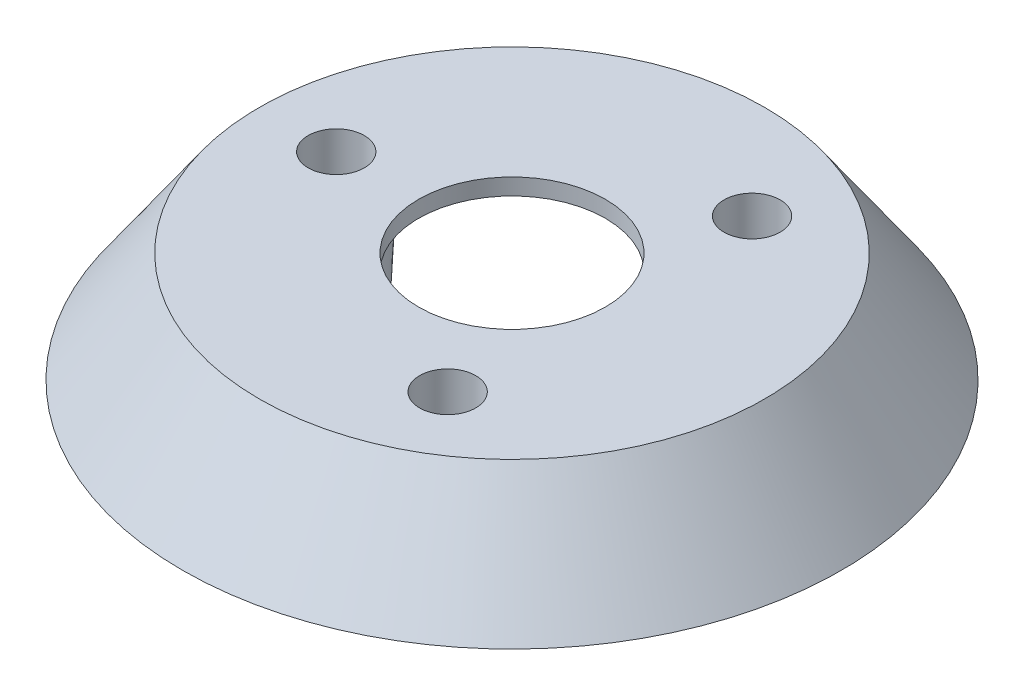
ISO-10303-21;
HEADER;
FILE_DESCRIPTION(('STEP AP214'),'2;1');
FILE_NAME('part.step','',(''),(''),'','','');
FILE_SCHEMA(('AUTOMOTIVE_DESIGN { 1 0 10303 214 1 1 1 1 }'));
ENDSEC;
DATA;
#1=APPLICATION_CONTEXT('core data for automotive mechanical design processes');
#2=APPLICATION_PROTOCOL_DEFINITION('international standard','automotive_design',2000,#1);
#3=PRODUCT_CONTEXT('',#1,'mechanical');
#4=PRODUCT('Part','Part','',(#3));
#5=PRODUCT_RELATED_PRODUCT_CATEGORY('part','',(#4));
#6=PRODUCT_DEFINITION_FORMATION('','',#4);
#7=PRODUCT_DEFINITION_CONTEXT('part definition',#1,'design');
#8=PRODUCT_DEFINITION('design','',#6,#7);
#9=PRODUCT_DEFINITION_SHAPE('','',#8);
#10=(LENGTH_UNIT() NAMED_UNIT(*) SI_UNIT(.MILLI.,.METRE.));
#11=(NAMED_UNIT(*) PLANE_ANGLE_UNIT() SI_UNIT($,.RADIAN.));
#12=(NAMED_UNIT(*) SI_UNIT($,.STERADIAN.) SOLID_ANGLE_UNIT());
#13=UNCERTAINTY_MEASURE_WITH_UNIT(LENGTH_MEASURE(1.E-05),#10,'distance_accuracy_value','');
#14=(GEOMETRIC_REPRESENTATION_CONTEXT(3) GLOBAL_UNCERTAINTY_ASSIGNED_CONTEXT((#13)) GLOBAL_UNIT_ASSIGNED_CONTEXT((#10,
#11,#12)) REPRESENTATION_CONTEXT('',''));
#15=CARTESIAN_POINT('',(0.,0.,0.));
#16=DIRECTION('',(0.,0.,1.));
#17=DIRECTION('',(1.,0.,0.));
#18=AXIS2_PLACEMENT_3D('',#15,#16,#17);
#19=CARTESIAN_POINT('',(0.,10.,0.));
#20=DIRECTION('',(0.,1.,0.));
#21=DIRECTION('',(0.,0.,1.));
#22=AXIS2_PLACEMENT_3D('',#19,#20,#21);
#23=PLANE('',#22);
#24=CARTESIAN_POINT('',(0.,10.,0.));
#25=DIRECTION('',(0.,1.,0.));
#26=DIRECTION('',(0.,0.,1.));
#27=AXIS2_PLACEMENT_3D('',#24,#25,#26);
#28=CIRCLE('',#27,8.5);
#29=CARTESIAN_POINT('',(0.,10.,8.5));
#30=VERTEX_POINT('',#29);
#31=EDGE_CURVE('E87',#30,#30,#28,.T.);
#32=ORIENTED_EDGE('',*,*,#31,.F.);
#33=EDGE_LOOP('',(#32));
#34=FACE_BOUND('',#33,.T.);
#35=CARTESIAN_POINT('',(7.99999999999987,10.,-13.8564064605511));
#36=DIRECTION('',(0.,1.,0.));
#37=DIRECTION('',(0.,0.,1.));
#38=AXIS2_PLACEMENT_3D('',#35,#36,#37);
#39=CIRCLE('',#38,2.55453387609415);
#40=CARTESIAN_POINT('',(7.99999999999987,10.,-16.4109403366452));
#41=VERTEX_POINT('',#40);
#42=EDGE_CURVE('E81',#41,#41,#39,.F.);
#43=ORIENTED_EDGE('',*,*,#42,.T.);
#44=EDGE_LOOP('',(#43));
#45=FACE_BOUND('',#44,.T.);
#46=CARTESIAN_POINT('',(8.00000000000007,10.,13.856406460551));
#47=DIRECTION('',(0.,1.,0.));
#48=DIRECTION('',(0.,0.,1.));
#49=AXIS2_PLACEMENT_3D('',#46,#47,#48);
#50=CIRCLE('',#49,2.55453387609415);
#51=CARTESIAN_POINT('',(8.00000000000007,10.,11.3018725844568));
#52=VERTEX_POINT('',#51);
#53=EDGE_CURVE('E75',#52,#52,#50,.F.);
#54=ORIENTED_EDGE('',*,*,#53,.T.);
#55=EDGE_LOOP('',(#54));
#56=FACE_BOUND('',#55,.T.);
#57=CARTESIAN_POINT('',(-16.,10.,0.));
#58=DIRECTION('',(0.,1.,0.));
#59=DIRECTION('',(0.,0.,1.));
#60=AXIS2_PLACEMENT_3D('',#57,#58,#59);
#61=CIRCLE('',#60,2.55453387609415);
#62=CARTESIAN_POINT('',(-16.,10.,-2.55453387609415));
#63=VERTEX_POINT('',#62);
#64=EDGE_CURVE('E67',#63,#63,#61,.F.);
#65=ORIENTED_EDGE('',*,*,#64,.T.);
#66=EDGE_LOOP('',(#65));
#67=FACE_BOUND('',#66,.T.);
#68=CARTESIAN_POINT('',(0.,10.,0.));
#69=DIRECTION('',(0.,1.,0.));
#70=DIRECTION('',(0.,0.,1.));
#71=AXIS2_PLACEMENT_3D('',#68,#69,#70);
#72=CIRCLE('',#71,22.9979246179029);
#73=CARTESIAN_POINT('',(0.,10.,22.9979246179029));
#74=VERTEX_POINT('',#73);
#75=EDGE_CURVE('E57',#74,#74,#72,.T.);
#76=ORIENTED_EDGE('',*,*,#75,.T.);
#77=EDGE_LOOP('',(#76));
#78=FACE_BOUND('',#77,.T.);
#79=ADVANCED_FACE('F31',(#34,#45,#56,#67,#78),#23,.T.);
#80=CARTESIAN_POINT('',(0.,0.,0.));
#81=DIRECTION('',(0.,1.,0.));
#82=DIRECTION('',(0.,0.,1.));
#83=AXIS2_PLACEMENT_3D('',#80,#81,#82);
#84=PLANE('',#83);
#85=CARTESIAN_POINT('',(0.,0.,0.));
#86=DIRECTION('',(0.,1.,0.));
#87=DIRECTION('',(0.,0.,1.));
#88=AXIS2_PLACEMENT_3D('',#85,#86,#87);
#89=CIRCLE('',#88,28.1688381168578);
#90=CARTESIAN_POINT('',(0.,0.,28.1688381168578));
#91=VERTEX_POINT('',#90);
#92=EDGE_CURVE('E64',#91,#91,#89,.T.);
#93=ORIENTED_EDGE('',*,*,#92,.T.);
#94=EDGE_LOOP('',(#93));
#95=FACE_BOUND('',#94,.T.);
#96=CARTESIAN_POINT('',(0.,0.,0.));
#97=DIRECTION('',(0.,1.,0.));
#98=DIRECTION('',(0.,0.,1.));
#99=AXIS2_PLACEMENT_3D('',#96,#97,#98);
#100=CIRCLE('',#99,30.);
#101=CARTESIAN_POINT('',(0.,0.,30.));
#102=VERTEX_POINT('',#101);
#103=EDGE_CURVE('E60',#102,#102,#100,.T.);
#104=ORIENTED_EDGE('',*,*,#103,.F.);
#105=EDGE_LOOP('',(#104));
#106=FACE_BOUND('',#105,.T.);
#107=ADVANCED_FACE('F123',(#95,#106),#84,.F.);
#108=CARTESIAN_POINT('',(0.,10.,0.));
#109=DIRECTION('',(0.,-1.,0.));
#110=DIRECTION('',(0.,0.,-1.));
#111=AXIS2_PLACEMENT_3D('',#108,#109,#110);
#112=CONICAL_SURFACE('',#111,22.9979246179029,0.610865238198013);
#113=ORIENTED_EDGE('',*,*,#103,.T.);
#114=EDGE_LOOP('',(#113));
#115=FACE_BOUND('',#114,.T.);
#116=ORIENTED_EDGE('',*,*,#75,.F.);
#117=EDGE_LOOP('',(#116));
#118=FACE_BOUND('',#117,.T.);
#119=ADVANCED_FACE('F100',(#115,#118),#112,.T.);
#120=CARTESIAN_POINT('',(0.,8.5,0.));
#121=DIRECTION('',(0.,1.,0.));
#122=DIRECTION('',(0.,0.,1.));
#123=AXIS2_PLACEMENT_3D('',#120,#121,#122);
#124=PLANE('',#123);
#125=CARTESIAN_POINT('',(0.,8.5,0.));
#126=DIRECTION('',(0.,-1.,0.));
#127=DIRECTION('',(0.,0.,-1.));
#128=AXIS2_PLACEMENT_3D('',#125,#126,#127);
#129=CIRCLE('',#128,8.5);
#130=CARTESIAN_POINT('',(0.,8.5,-8.5));
#131=VERTEX_POINT('',#130);
#132=EDGE_CURVE('E90',#131,#131,#129,.T.);
#133=ORIENTED_EDGE('',*,*,#132,.F.);
#134=EDGE_LOOP('',(#133));
#135=FACE_BOUND('',#134,.T.);
#136=CARTESIAN_POINT('',(7.99999999999987,8.5,-13.8564064605511));
#137=DIRECTION('',(0.,1.,0.));
#138=DIRECTION('',(0.,0.,1.));
#139=AXIS2_PLACEMENT_3D('',#136,#137,#138);
#140=CIRCLE('',#139,4.);
#141=CARTESIAN_POINT('',(7.99999999999987,8.5,-9.85640646055109));
#142=VERTEX_POINT('',#141);
#143=EDGE_CURVE('E42',#142,#142,#140,.F.);
#144=ORIENTED_EDGE('',*,*,#143,.F.);
#145=EDGE_LOOP('',(#144));
#146=FACE_BOUND('',#145,.T.);
#147=CARTESIAN_POINT('',(8.00000000000007,8.5,13.856406460551));
#148=DIRECTION('',(0.,1.,0.));
#149=DIRECTION('',(0.,0.,1.));
#150=AXIS2_PLACEMENT_3D('',#147,#148,#149);
#151=CIRCLE('',#150,4.);
#152=CARTESIAN_POINT('',(8.00000000000007,8.5,17.856406460551));
#153=VERTEX_POINT('',#152);
#154=EDGE_CURVE('E46',#153,#153,#151,.F.);
#155=ORIENTED_EDGE('',*,*,#154,.F.);
#156=EDGE_LOOP('',(#155));
#157=FACE_BOUND('',#156,.T.);
#158=CARTESIAN_POINT('',(-16.,8.5,0.));
#159=DIRECTION('',(0.,1.,0.));
#160=DIRECTION('',(0.,0.,1.));
#161=AXIS2_PLACEMENT_3D('',#158,#159,#160);
#162=CIRCLE('',#161,4.);
#163=CARTESIAN_POINT('',(-16.,8.5,4.));
#164=VERTEX_POINT('',#163);
#165=EDGE_CURVE('E54',#164,#164,#162,.F.);
#166=ORIENTED_EDGE('',*,*,#165,.F.);
#167=EDGE_LOOP('',(#166));
#168=FACE_BOUND('',#167,.T.);
#169=CARTESIAN_POINT('',(0.,8.5,0.));
#170=DIRECTION('',(0.,1.,0.));
#171=DIRECTION('',(0.,0.,1.));
#172=AXIS2_PLACEMENT_3D('',#169,#170,#171);
#173=CIRCLE('',#172,22.2170740420753);
#174=CARTESIAN_POINT('',(0.,8.5,22.2170740420753));
#175=VERTEX_POINT('',#174);
#176=EDGE_CURVE('E63',#175,#175,#173,.T.);
#177=ORIENTED_EDGE('',*,*,#176,.F.);
#178=EDGE_LOOP('',(#177));
#179=FACE_BOUND('',#178,.T.);
#180=ADVANCED_FACE('F96',(#135,#146,#157,#168,#179),#124,.F.);
#181=CARTESIAN_POINT('',(0.,9.13963534547343,0.));
#182=DIRECTION('',(0.,-1.,0.));
#183=DIRECTION('',(0.,0.,-1.));
#184=AXIS2_PLACEMENT_3D('',#181,#182,#183);
#185=CONICAL_SURFACE('',#184,21.7691965514694,0.610865238198013);
#186=ORIENTED_EDGE('',*,*,#92,.F.);
#187=EDGE_LOOP('',(#186));
#188=FACE_BOUND('',#187,.T.);
#189=ORIENTED_EDGE('',*,*,#176,.T.);
#190=EDGE_LOOP('',(#189));
#191=FACE_BOUND('',#190,.T.);
#192=ADVANCED_FACE('F99',(#188,#191),#185,.F.);
#193=CARTESIAN_POINT('',(-16.,0.,0.));
#194=DIRECTION('',(0.,-1.,0.));
#195=DIRECTION('',(0.,0.,-1.));
#196=AXIS2_PLACEMENT_3D('',#193,#194,#195);
#197=PLANE('',#196);
#198=CARTESIAN_POINT('',(-16.,0.,0.));
#199=DIRECTION('',(0.,-1.,0.));
#200=DIRECTION('',(0.,0.,-1.));
#201=AXIS2_PLACEMENT_3D('',#198,#199,#200);
#202=CIRCLE('',#201,2.55453387609415);
#203=CARTESIAN_POINT('',(-16.,0.,-2.55453387609415));
#204=VERTEX_POINT('',#203);
#205=EDGE_CURVE('E72',#204,#204,#202,.T.);
#206=ORIENTED_EDGE('',*,*,#205,.F.);
#207=EDGE_LOOP('',(#206));
#208=FACE_BOUND('',#207,.T.);
#209=CARTESIAN_POINT('',(-16.,0.,0.));
#210=DIRECTION('',(0.,-1.,0.));
#211=DIRECTION('',(0.,0.,-1.));
#212=AXIS2_PLACEMENT_3D('',#209,#210,#211);
#213=CIRCLE('',#212,3.55453387609415);
#214=CARTESIAN_POINT('',(-16.,0.,-3.55453387609415));
#215=VERTEX_POINT('',#214);
#216=EDGE_CURVE('E51',#215,#215,#213,.T.);
#217=ORIENTED_EDGE('',*,*,#216,.T.);
#218=EDGE_LOOP('',(#217));
#219=FACE_BOUND('',#218,.T.);
#220=ADVANCED_FACE('F111',(#208,#219),#197,.T.);
#221=CARTESIAN_POINT('',(-16.,0.,0.));
#222=DIRECTION('',(0.,1.,0.));
#223=DIRECTION('',(0.,0.,1.));
#224=AXIS2_PLACEMENT_3D('',#221,#222,#223);
#225=CONICAL_SURFACE('',#224,3.55453387609415,0.0523598775598264);
#226=ORIENTED_EDGE('',*,*,#165,.T.);
#227=EDGE_LOOP('',(#226));
#228=FACE_BOUND('',#227,.T.);
#229=ORIENTED_EDGE('',*,*,#216,.F.);
#230=EDGE_LOOP('',(#229));
#231=FACE_BOUND('',#230,.T.);
#232=ADVANCED_FACE('F117',(#228,#231),#225,.T.);
#233=CARTESIAN_POINT('',(-16.,17.2253129062277,0.));
#234=DIRECTION('',(0.,-1.,0.));
#235=DIRECTION('',(0.,0.,-1.));
#236=AXIS2_PLACEMENT_3D('',#233,#234,#235);
#237=CYLINDRICAL_SURFACE('',#236,2.55453387609415);
#238=CARTESIAN_POINT('',(-16.,0.,-2.55453387609415));
#239=CARTESIAN_POINT('',(-16.,0.104166666666667,-2.55453387609415));
#240=CARTESIAN_POINT('',(-16.,0.208333333333334,-2.55453387609415));
#241=CARTESIAN_POINT('',(-16.,0.416666666666667,-2.55453387609415));
#242=CARTESIAN_POINT('',(-16.,0.520833333333334,-2.55453387609415));
#243=CARTESIAN_POINT('',(-16.,0.729166666666667,-2.55453387609415));
#244=CARTESIAN_POINT('',(-16.,0.833333333333334,-2.55453387609415));
#245=CARTESIAN_POINT('',(-16.,1.04166666666667,-2.55453387609415));
#246=CARTESIAN_POINT('',(-16.,1.14583333333333,-2.55453387609415));
#247=CARTESIAN_POINT('',(-16.,1.35416666666667,-2.55453387609415));
#248=CARTESIAN_POINT('',(-16.,1.45833333333333,-2.55453387609415));
#249=CARTESIAN_POINT('',(-16.,1.66666666666667,-2.55453387609415));
#250=CARTESIAN_POINT('',(-16.,1.77083333333333,-2.55453387609415));
#251=CARTESIAN_POINT('',(-16.,1.97916666666667,-2.55453387609415));
#252=CARTESIAN_POINT('',(-16.,2.08333333333333,-2.55453387609415));
#253=CARTESIAN_POINT('',(-16.,2.29166666666667,-2.55453387609415));
#254=CARTESIAN_POINT('',(-16.,2.39583333333333,-2.55453387609415));
#255=CARTESIAN_POINT('',(-16.,2.60416666666667,-2.55453387609415));
#256=CARTESIAN_POINT('',(-16.,2.70833333333333,-2.55453387609415));
#257=CARTESIAN_POINT('',(-16.,2.91666666666667,-2.55453387609415));
#258=CARTESIAN_POINT('',(-16.,3.02083333333333,-2.55453387609415));
#259=CARTESIAN_POINT('',(-16.,3.22916666666667,-2.55453387609415));
#260=CARTESIAN_POINT('',(-16.,3.33333333333333,-2.55453387609415));
#261=CARTESIAN_POINT('',(-16.,3.54166666666666,-2.55453387609415));
#262=CARTESIAN_POINT('',(-16.,3.64583333333333,-2.55453387609415));
#263=CARTESIAN_POINT('',(-16.,3.85416666666667,-2.55453387609415));
#264=CARTESIAN_POINT('',(-16.,3.95833333333333,-2.55453387609415));
#265=CARTESIAN_POINT('',(-16.,4.16666666666667,-2.55453387609415));
#266=CARTESIAN_POINT('',(-16.,4.27083333333333,-2.55453387609415));
#267=CARTESIAN_POINT('',(-16.,4.47916666666667,-2.55453387609415));
#268=CARTESIAN_POINT('',(-16.,4.58333333333333,-2.55453387609415));
#269=CARTESIAN_POINT('',(-16.,4.79166666666667,-2.55453387609415));
#270=CARTESIAN_POINT('',(-16.,4.89583333333333,-2.55453387609415));
#271=CARTESIAN_POINT('',(-16.,5.10416666666667,-2.55453387609415));
#272=CARTESIAN_POINT('',(-16.,5.20833333333333,-2.55453387609415));
#273=CARTESIAN_POINT('',(-16.,5.41666666666667,-2.55453387609415));
#274=CARTESIAN_POINT('',(-16.,5.52083333333333,-2.55453387609415));
#275=CARTESIAN_POINT('',(-16.,5.72916666666667,-2.55453387609415));
#276=CARTESIAN_POINT('',(-16.,5.83333333333333,-2.55453387609415));
#277=CARTESIAN_POINT('',(-16.,6.04166666666667,-2.55453387609415));
#278=CARTESIAN_POINT('',(-16.,6.14583333333333,-2.55453387609415));
#279=CARTESIAN_POINT('',(-16.,6.35416666666667,-2.55453387609415));
#280=CARTESIAN_POINT('',(-16.,6.45833333333333,-2.55453387609415));
#281=CARTESIAN_POINT('',(-16.,6.66666666666667,-2.55453387609415));
#282=CARTESIAN_POINT('',(-16.,6.77083333333333,-2.55453387609415));
#283=CARTESIAN_POINT('',(-16.,6.97916666666667,-2.55453387609415));
#284=CARTESIAN_POINT('',(-16.,7.08333333333333,-2.55453387609415));
#285=CARTESIAN_POINT('',(-16.,7.29166666666667,-2.55453387609415));
#286=CARTESIAN_POINT('',(-16.,7.39583333333333,-2.55453387609415));
#287=CARTESIAN_POINT('',(-16.,7.60416666666667,-2.55453387609415));
#288=CARTESIAN_POINT('',(-16.,7.70833333333333,-2.55453387609415));
#289=CARTESIAN_POINT('',(-16.,7.91666666666667,-2.55453387609415));
#290=CARTESIAN_POINT('',(-16.,8.02083333333333,-2.55453387609415));
#291=CARTESIAN_POINT('',(-16.,8.22916666666667,-2.55453387609415));
#292=CARTESIAN_POINT('',(-16.,8.33333333333333,-2.55453387609415));
#293=CARTESIAN_POINT('',(-16.,8.54166666666667,-2.55453387609415));
#294=CARTESIAN_POINT('',(-16.,8.64583333333333,-2.55453387609415));
#295=CARTESIAN_POINT('',(-16.,8.85416666666667,-2.55453387609415));
#296=CARTESIAN_POINT('',(-16.,8.95833333333333,-2.55453387609415));
#297=CARTESIAN_POINT('',(-16.,9.16666666666667,-2.55453387609415));
#298=CARTESIAN_POINT('',(-16.,9.27083333333333,-2.55453387609415));
#299=CARTESIAN_POINT('',(-16.,9.47916666666667,-2.55453387609415));
#300=CARTESIAN_POINT('',(-16.,9.58333333333333,-2.55453387609415));
#301=CARTESIAN_POINT('',(-16.,9.79166666666667,-2.55453387609415));
#302=CARTESIAN_POINT('',(-16.,9.89583333333333,-2.55453387609415));
#303=CARTESIAN_POINT('',(-16.,10.,-2.55453387609415));
#304=B_SPLINE_CURVE_WITH_KNOTS('',3,(#238,#239,#240,#241,#242,#243,#244,#245,#246,#247,#248,
#249,#250,#251,#252,#253,#254,#255,#256,#257,#258,#259,#260,#261,#262,#263,#264,#265,#266,#267,
#268,#269,#270,#271,#272,#273,#274,#275,#276,#277,#278,#279,#280,#281,#282,#283,#284,#285,#286,
#287,#288,#289,#290,#291,#292,#293,#294,#295,#296,#297,#298,#299,#300,#301,#302,#303),
.UNSPECIFIED.,.F.,.F.,(4,2,2,2,2,2,2,2,2,2,2,2,2,2,2,2,2,2,2,2,2,2,2,2,2,2,2,2,2,2,2,2,4),(0.,
0.3125,0.625000000000001,0.937500000000001,1.25,1.5625,1.875,2.1875,2.5,2.8125,3.125,3.4375,
3.75,4.0625,4.375,4.6875,5.,5.3125,5.625,5.9375,6.25,6.5625,6.875,7.1875,7.5,7.8125,8.125,
8.4375,8.75,9.0625,9.375,9.6875,10.),.UNSPECIFIED.);
#305=EDGE_CURVE('BSEAM137',#204,#63,#304,.T.);
#306=ORIENTED_EDGE('',*,*,#205,.T.);
#307=ORIENTED_EDGE('',*,*,#64,.F.);
#308=ORIENTED_EDGE('',*,*,#305,.T.);
#309=ORIENTED_EDGE('',*,*,#305,.F.);
#310=EDGE_LOOP('',(#306,#308,#307,#309));
#311=FACE_BOUND('',#310,.T.);
#312=ADVANCED_FACE('F137',(#311),#237,.F.);
#313=CARTESIAN_POINT('',(8.00000000000007,0.,13.856406460551));
#314=DIRECTION('',(0.,-1.,0.));
#315=DIRECTION('',(-0.866025403784436,0.,0.500000000000004));
#316=AXIS2_PLACEMENT_3D('',#313,#314,#315);
#317=PLANE('',#316);
#318=CARTESIAN_POINT('',(8.00000000000007,0.,13.856406460551));
#319=DIRECTION('',(0.,-1.,0.));
#320=DIRECTION('',(-0.866025403784436,0.,0.500000000000004));
#321=AXIS2_PLACEMENT_3D('',#318,#319,#320);
#322=CIRCLE('',#321,2.55453387609415);
#323=CARTESIAN_POINT('',(8.00000000000007,0.,11.3018725844568));
#324=VERTEX_POINT('',#323);
#325=EDGE_CURVE('E78',#324,#324,#322,.T.);
#326=ORIENTED_EDGE('',*,*,#325,.F.);
#327=EDGE_LOOP('',(#326));
#328=FACE_BOUND('',#327,.T.);
#329=CARTESIAN_POINT('',(8.00000000000007,0.,13.856406460551));
#330=DIRECTION('',(0.,-1.,0.));
#331=DIRECTION('',(0.,0.,-1.));
#332=AXIS2_PLACEMENT_3D('',#329,#330,#331);
#333=CIRCLE('',#332,3.55453387609415);
#334=CARTESIAN_POINT('',(8.00000000000007,0.,10.3018725844568));
#335=VERTEX_POINT('',#334);
#336=EDGE_CURVE('E38',#335,#335,#333,.T.);
#337=ORIENTED_EDGE('',*,*,#336,.T.);
#338=EDGE_LOOP('',(#337));
#339=FACE_BOUND('',#338,.T.);
#340=ADVANCED_FACE('F149',(#328,#339),#317,.T.);
#341=CARTESIAN_POINT('',(7.99999999999987,0.,-13.8564064605511));
#342=DIRECTION('',(0.,-1.,0.));
#343=DIRECTION('',(0.866025403784443,0.,0.499999999999992));
#344=AXIS2_PLACEMENT_3D('',#341,#342,#343);
#345=PLANE('',#344);
#346=CARTESIAN_POINT('',(7.99999999999987,0.,-13.8564064605511));
#347=DIRECTION('',(0.,-1.,0.));
#348=DIRECTION('',(0.866025403784443,0.,0.499999999999992));
#349=AXIS2_PLACEMENT_3D('',#346,#347,#348);
#350=CIRCLE('',#349,2.55453387609415);
#351=CARTESIAN_POINT('',(7.99999999999987,0.,-16.4109403366452));
#352=VERTEX_POINT('',#351);
#353=EDGE_CURVE('E84',#352,#352,#350,.T.);
#354=ORIENTED_EDGE('',*,*,#353,.F.);
#355=EDGE_LOOP('',(#354));
#356=FACE_BOUND('',#355,.T.);
#357=CARTESIAN_POINT('',(7.99999999999987,0.,-13.8564064605511));
#358=DIRECTION('',(0.,-1.,0.));
#359=DIRECTION('',(0.,0.,-1.));
#360=AXIS2_PLACEMENT_3D('',#357,#358,#359);
#361=CIRCLE('',#360,3.55453387609417);
#362=CARTESIAN_POINT('',(7.99999999999987,0.,-17.4109403366453));
#363=VERTEX_POINT('',#362);
#364=EDGE_CURVE('E10',#363,#363,#361,.T.);
#365=ORIENTED_EDGE('',*,*,#364,.T.);
#366=EDGE_LOOP('',(#365));
#367=FACE_BOUND('',#366,.T.);
#368=ADVANCED_FACE('F141',(#356,#367),#345,.T.);
#369=CARTESIAN_POINT('',(8.00000000000007,0.,13.856406460551));
#370=DIRECTION('',(0.,1.,0.));
#371=DIRECTION('',(0.,0.,1.));
#372=AXIS2_PLACEMENT_3D('',#369,#370,#371);
#373=CONICAL_SURFACE('',#372,3.55453387609415,0.0523598775598266);
#374=ORIENTED_EDGE('',*,*,#154,.T.);
#375=EDGE_LOOP('',(#374));
#376=FACE_BOUND('',#375,.T.);
#377=ORIENTED_EDGE('',*,*,#336,.F.);
#378=EDGE_LOOP('',(#377));
#379=FACE_BOUND('',#378,.T.);
#380=ADVANCED_FACE('F139',(#376,#379),#373,.T.);
#381=CARTESIAN_POINT('',(7.99999999999987,0.,-13.8564064605511));
#382=DIRECTION('',(0.,1.,0.));
#383=DIRECTION('',(0.,0.,1.));
#384=AXIS2_PLACEMENT_3D('',#381,#382,#383);
#385=CONICAL_SURFACE('',#384,3.55453387609417,0.0523598775598267);
#386=ORIENTED_EDGE('',*,*,#143,.T.);
#387=EDGE_LOOP('',(#386));
#388=FACE_BOUND('',#387,.T.);
#389=ORIENTED_EDGE('',*,*,#364,.F.);
#390=EDGE_LOOP('',(#389));
#391=FACE_BOUND('',#390,.T.);
#392=ADVANCED_FACE('F33',(#388,#391),#385,.T.);
#393=CARTESIAN_POINT('',(8.00000000000007,17.2253129062277,13.856406460551));
#394=DIRECTION('',(0.,-1.,0.));
#395=DIRECTION('',(0.,0.,-1.));
#396=AXIS2_PLACEMENT_3D('',#393,#394,#395);
#397=CYLINDRICAL_SURFACE('',#396,2.55453387609415);
#398=CARTESIAN_POINT('',(8.00000000000007,0.,11.3018725844568));
#399=CARTESIAN_POINT('',(8.00000000000007,0.104166666666667,11.3018725844568));
#400=CARTESIAN_POINT('',(8.00000000000007,0.208333333333334,11.3018725844568));
#401=CARTESIAN_POINT('',(8.00000000000007,0.416666666666667,11.3018725844568));
#402=CARTESIAN_POINT('',(8.00000000000007,0.520833333333334,11.3018725844568));
#403=CARTESIAN_POINT('',(8.00000000000007,0.729166666666667,11.3018725844568));
#404=CARTESIAN_POINT('',(8.00000000000007,0.833333333333334,11.3018725844568));
#405=CARTESIAN_POINT('',(8.00000000000007,1.04166666666667,11.3018725844568));
#406=CARTESIAN_POINT('',(8.00000000000007,1.14583333333333,11.3018725844568));
#407=CARTESIAN_POINT('',(8.00000000000007,1.35416666666667,11.3018725844568));
#408=CARTESIAN_POINT('',(8.00000000000007,1.45833333333333,11.3018725844568));
#409=CARTESIAN_POINT('',(8.00000000000007,1.66666666666667,11.3018725844568));
#410=CARTESIAN_POINT('',(8.00000000000007,1.77083333333333,11.3018725844568));
#411=CARTESIAN_POINT('',(8.00000000000007,1.97916666666667,11.3018725844568));
#412=CARTESIAN_POINT('',(8.00000000000007,2.08333333333333,11.3018725844568));
#413=CARTESIAN_POINT('',(8.00000000000007,2.29166666666667,11.3018725844568));
#414=CARTESIAN_POINT('',(8.00000000000007,2.39583333333333,11.3018725844568));
#415=CARTESIAN_POINT('',(8.00000000000007,2.60416666666667,11.3018725844568));
#416=CARTESIAN_POINT('',(8.00000000000007,2.70833333333333,11.3018725844568));
#417=CARTESIAN_POINT('',(8.00000000000007,2.91666666666667,11.3018725844568));
#418=CARTESIAN_POINT('',(8.00000000000007,3.02083333333333,11.3018725844568));
#419=CARTESIAN_POINT('',(8.00000000000007,3.22916666666667,11.3018725844568));
#420=CARTESIAN_POINT('',(8.00000000000007,3.33333333333333,11.3018725844568));
#421=CARTESIAN_POINT('',(8.00000000000007,3.54166666666666,11.3018725844568));
#422=CARTESIAN_POINT('',(8.00000000000007,3.64583333333333,11.3018725844568));
#423=CARTESIAN_POINT('',(8.00000000000007,3.85416666666667,11.3018725844568));
#424=CARTESIAN_POINT('',(8.00000000000007,3.95833333333333,11.3018725844568));
#425=CARTESIAN_POINT('',(8.00000000000007,4.16666666666667,11.3018725844568));
#426=CARTESIAN_POINT('',(8.00000000000007,4.27083333333333,11.3018725844568));
#427=CARTESIAN_POINT('',(8.00000000000007,4.47916666666667,11.3018725844568));
#428=CARTESIAN_POINT('',(8.00000000000007,4.58333333333333,11.3018725844568));
#429=CARTESIAN_POINT('',(8.00000000000007,4.79166666666667,11.3018725844568));
#430=CARTESIAN_POINT('',(8.00000000000007,4.89583333333333,11.3018725844568));
#431=CARTESIAN_POINT('',(8.00000000000007,5.10416666666667,11.3018725844568));
#432=CARTESIAN_POINT('',(8.00000000000007,5.20833333333333,11.3018725844568));
#433=CARTESIAN_POINT('',(8.00000000000007,5.41666666666667,11.3018725844568));
#434=CARTESIAN_POINT('',(8.00000000000007,5.52083333333333,11.3018725844568));
#435=CARTESIAN_POINT('',(8.00000000000007,5.72916666666667,11.3018725844568));
#436=CARTESIAN_POINT('',(8.00000000000007,5.83333333333333,11.3018725844568));
#437=CARTESIAN_POINT('',(8.00000000000007,6.04166666666667,11.3018725844568));
#438=CARTESIAN_POINT('',(8.00000000000007,6.14583333333333,11.3018725844568));
#439=CARTESIAN_POINT('',(8.00000000000007,6.35416666666667,11.3018725844568));
#440=CARTESIAN_POINT('',(8.00000000000007,6.45833333333333,11.3018725844568));
#441=CARTESIAN_POINT('',(8.00000000000007,6.66666666666667,11.3018725844568));
#442=CARTESIAN_POINT('',(8.00000000000007,6.77083333333333,11.3018725844568));
#443=CARTESIAN_POINT('',(8.00000000000007,6.97916666666667,11.3018725844568));
#444=CARTESIAN_POINT('',(8.00000000000007,7.08333333333333,11.3018725844568));
#445=CARTESIAN_POINT('',(8.00000000000007,7.29166666666667,11.3018725844568));
#446=CARTESIAN_POINT('',(8.00000000000007,7.39583333333333,11.3018725844568));
#447=CARTESIAN_POINT('',(8.00000000000007,7.60416666666667,11.3018725844568));
#448=CARTESIAN_POINT('',(8.00000000000007,7.70833333333333,11.3018725844568));
#449=CARTESIAN_POINT('',(8.00000000000007,7.91666666666667,11.3018725844568));
#450=CARTESIAN_POINT('',(8.00000000000007,8.02083333333333,11.3018725844568));
#451=CARTESIAN_POINT('',(8.00000000000007,8.22916666666667,11.3018725844568));
#452=CARTESIAN_POINT('',(8.00000000000007,8.33333333333333,11.3018725844568));
#453=CARTESIAN_POINT('',(8.00000000000007,8.54166666666667,11.3018725844568));
#454=CARTESIAN_POINT('',(8.00000000000007,8.64583333333333,11.3018725844568));
#455=CARTESIAN_POINT('',(8.00000000000007,8.85416666666667,11.3018725844568));
#456=CARTESIAN_POINT('',(8.00000000000007,8.95833333333333,11.3018725844568));
#457=CARTESIAN_POINT('',(8.00000000000007,9.16666666666667,11.3018725844568));
#458=CARTESIAN_POINT('',(8.00000000000007,9.27083333333333,11.3018725844568));
#459=CARTESIAN_POINT('',(8.00000000000007,9.47916666666667,11.3018725844568));
#460=CARTESIAN_POINT('',(8.00000000000007,9.58333333333333,11.3018725844568));
#461=CARTESIAN_POINT('',(8.00000000000007,9.79166666666667,11.3018725844568));
#462=CARTESIAN_POINT('',(8.00000000000007,9.89583333333333,11.3018725844568));
#463=CARTESIAN_POINT('',(8.00000000000007,10.,11.3018725844568));
#464=B_SPLINE_CURVE_WITH_KNOTS('',3,(#398,#399,#400,#401,#402,#403,#404,#405,#406,#407,#408,
#409,#410,#411,#412,#413,#414,#415,#416,#417,#418,#419,#420,#421,#422,#423,#424,#425,#426,#427,
#428,#429,#430,#431,#432,#433,#434,#435,#436,#437,#438,#439,#440,#441,#442,#443,#444,#445,#446,
#447,#448,#449,#450,#451,#452,#453,#454,#455,#456,#457,#458,#459,#460,#461,#462,#463),
.UNSPECIFIED.,.F.,.F.,(4,2,2,2,2,2,2,2,2,2,2,2,2,2,2,2,2,2,2,2,2,2,2,2,2,2,2,2,2,2,2,2,4),(0.,
0.3125,0.625000000000001,0.937500000000001,1.25,1.5625,1.875,2.1875,2.5,2.8125,3.125,3.4375,
3.75,4.0625,4.375,4.6875,5.,5.3125,5.625,5.9375,6.25,6.5625,6.875,7.1875,7.5,7.8125,8.125,
8.4375,8.75,9.0625,9.375,9.6875,10.),.UNSPECIFIED.);
#465=EDGE_CURVE('BSEAM147',#324,#52,#464,.T.);
#466=ORIENTED_EDGE('',*,*,#325,.T.);
#467=ORIENTED_EDGE('',*,*,#53,.F.);
#468=ORIENTED_EDGE('',*,*,#465,.T.);
#469=ORIENTED_EDGE('',*,*,#465,.F.);
#470=EDGE_LOOP('',(#466,#468,#467,#469));
#471=FACE_BOUND('',#470,.T.);
#472=ADVANCED_FACE('F147',(#471),#397,.F.);
#473=CARTESIAN_POINT('',(7.99999999999987,17.2253129062277,-13.8564064605511));
#474=DIRECTION('',(0.,-1.,0.));
#475=DIRECTION('',(0.,0.,-1.));
#476=AXIS2_PLACEMENT_3D('',#473,#474,#475);
#477=CYLINDRICAL_SURFACE('',#476,2.55453387609415);
#478=CARTESIAN_POINT('',(7.99999999999987,0.,-16.4109403366452));
#479=CARTESIAN_POINT('',(7.99999999999987,0.104166666666667,-16.4109403366452));
#480=CARTESIAN_POINT('',(7.99999999999987,0.208333333333334,-16.4109403366452));
#481=CARTESIAN_POINT('',(7.99999999999987,0.416666666666667,-16.4109403366452));
#482=CARTESIAN_POINT('',(7.99999999999987,0.520833333333334,-16.4109403366452));
#483=CARTESIAN_POINT('',(7.99999999999987,0.729166666666667,-16.4109403366452));
#484=CARTESIAN_POINT('',(7.99999999999987,0.833333333333334,-16.4109403366452));
#485=CARTESIAN_POINT('',(7.99999999999987,1.04166666666667,-16.4109403366452));
#486=CARTESIAN_POINT('',(7.99999999999987,1.14583333333333,-16.4109403366452));
#487=CARTESIAN_POINT('',(7.99999999999987,1.35416666666667,-16.4109403366452));
#488=CARTESIAN_POINT('',(7.99999999999987,1.45833333333333,-16.4109403366452));
#489=CARTESIAN_POINT('',(7.99999999999987,1.66666666666667,-16.4109403366452));
#490=CARTESIAN_POINT('',(7.99999999999987,1.77083333333333,-16.4109403366452));
#491=CARTESIAN_POINT('',(7.99999999999987,1.97916666666667,-16.4109403366452));
#492=CARTESIAN_POINT('',(7.99999999999987,2.08333333333333,-16.4109403366452));
#493=CARTESIAN_POINT('',(7.99999999999987,2.29166666666667,-16.4109403366452));
#494=CARTESIAN_POINT('',(7.99999999999987,2.39583333333333,-16.4109403366452));
#495=CARTESIAN_POINT('',(7.99999999999987,2.60416666666667,-16.4109403366452));
#496=CARTESIAN_POINT('',(7.99999999999987,2.70833333333333,-16.4109403366452));
#497=CARTESIAN_POINT('',(7.99999999999987,2.91666666666667,-16.4109403366452));
#498=CARTESIAN_POINT('',(7.99999999999987,3.02083333333333,-16.4109403366452));
#499=CARTESIAN_POINT('',(7.99999999999987,3.22916666666667,-16.4109403366452));
#500=CARTESIAN_POINT('',(7.99999999999987,3.33333333333333,-16.4109403366452));
#501=CARTESIAN_POINT('',(7.99999999999987,3.54166666666666,-16.4109403366452));
#502=CARTESIAN_POINT('',(7.99999999999987,3.64583333333333,-16.4109403366452));
#503=CARTESIAN_POINT('',(7.99999999999987,3.85416666666667,-16.4109403366452));
#504=CARTESIAN_POINT('',(7.99999999999987,3.95833333333333,-16.4109403366452));
#505=CARTESIAN_POINT('',(7.99999999999987,4.16666666666667,-16.4109403366452));
#506=CARTESIAN_POINT('',(7.99999999999987,4.27083333333333,-16.4109403366452));
#507=CARTESIAN_POINT('',(7.99999999999987,4.47916666666667,-16.4109403366452));
#508=CARTESIAN_POINT('',(7.99999999999987,4.58333333333333,-16.4109403366452));
#509=CARTESIAN_POINT('',(7.99999999999987,4.79166666666667,-16.4109403366452));
#510=CARTESIAN_POINT('',(7.99999999999987,4.89583333333333,-16.4109403366452));
#511=CARTESIAN_POINT('',(7.99999999999987,5.10416666666667,-16.4109403366452));
#512=CARTESIAN_POINT('',(7.99999999999987,5.20833333333333,-16.4109403366452));
#513=CARTESIAN_POINT('',(7.99999999999987,5.41666666666667,-16.4109403366452));
#514=CARTESIAN_POINT('',(7.99999999999987,5.52083333333333,-16.4109403366452));
#515=CARTESIAN_POINT('',(7.99999999999987,5.72916666666667,-16.4109403366452));
#516=CARTESIAN_POINT('',(7.99999999999987,5.83333333333333,-16.4109403366452));
#517=CARTESIAN_POINT('',(7.99999999999987,6.04166666666667,-16.4109403366452));
#518=CARTESIAN_POINT('',(7.99999999999987,6.14583333333333,-16.4109403366452));
#519=CARTESIAN_POINT('',(7.99999999999987,6.35416666666667,-16.4109403366452));
#520=CARTESIAN_POINT('',(7.99999999999987,6.45833333333333,-16.4109403366452));
#521=CARTESIAN_POINT('',(7.99999999999987,6.66666666666667,-16.4109403366452));
#522=CARTESIAN_POINT('',(7.99999999999987,6.77083333333333,-16.4109403366452));
#523=CARTESIAN_POINT('',(7.99999999999987,6.97916666666667,-16.4109403366452));
#524=CARTESIAN_POINT('',(7.99999999999987,7.08333333333333,-16.4109403366452));
#525=CARTESIAN_POINT('',(7.99999999999987,7.29166666666667,-16.4109403366452));
#526=CARTESIAN_POINT('',(7.99999999999987,7.39583333333333,-16.4109403366452));
#527=CARTESIAN_POINT('',(7.99999999999987,7.60416666666667,-16.4109403366452));
#528=CARTESIAN_POINT('',(7.99999999999987,7.70833333333333,-16.4109403366452));
#529=CARTESIAN_POINT('',(7.99999999999987,7.91666666666667,-16.4109403366452));
#530=CARTESIAN_POINT('',(7.99999999999987,8.02083333333333,-16.4109403366452));
#531=CARTESIAN_POINT('',(7.99999999999987,8.22916666666667,-16.4109403366452));
#532=CARTESIAN_POINT('',(7.99999999999987,8.33333333333333,-16.4109403366452));
#533=CARTESIAN_POINT('',(7.99999999999987,8.54166666666667,-16.4109403366452));
#534=CARTESIAN_POINT('',(7.99999999999987,8.64583333333333,-16.4109403366452));
#535=CARTESIAN_POINT('',(7.99999999999987,8.85416666666667,-16.4109403366452));
#536=CARTESIAN_POINT('',(7.99999999999987,8.95833333333333,-16.4109403366452));
#537=CARTESIAN_POINT('',(7.99999999999987,9.16666666666667,-16.4109403366452));
#538=CARTESIAN_POINT('',(7.99999999999987,9.27083333333333,-16.4109403366452));
#539=CARTESIAN_POINT('',(7.99999999999987,9.47916666666667,-16.4109403366452));
#540=CARTESIAN_POINT('',(7.99999999999987,9.58333333333333,-16.4109403366452));
#541=CARTESIAN_POINT('',(7.99999999999987,9.79166666666667,-16.4109403366452));
#542=CARTESIAN_POINT('',(7.99999999999987,9.89583333333333,-16.4109403366452));
#543=CARTESIAN_POINT('',(7.99999999999987,10.,-16.4109403366452));
#544=B_SPLINE_CURVE_WITH_KNOTS('',3,(#478,#479,#480,#481,#482,#483,#484,#485,#486,#487,#488,
#489,#490,#491,#492,#493,#494,#495,#496,#497,#498,#499,#500,#501,#502,#503,#504,#505,#506,#507,
#508,#509,#510,#511,#512,#513,#514,#515,#516,#517,#518,#519,#520,#521,#522,#523,#524,#525,#526,
#527,#528,#529,#530,#531,#532,#533,#534,#535,#536,#537,#538,#539,#540,#541,#542,#543),
.UNSPECIFIED.,.F.,.F.,(4,2,2,2,2,2,2,2,2,2,2,2,2,2,2,2,2,2,2,2,2,2,2,2,2,2,2,2,2,2,2,2,4),(0.,
0.3125,0.625000000000001,0.937500000000001,1.25,1.5625,1.875,2.1875,2.5,2.8125,3.125,3.4375,
3.75,4.0625,4.375,4.6875,5.,5.3125,5.625,5.9375,6.25,6.5625,6.875,7.1875,7.5,7.8125,8.125,
8.4375,8.75,9.0625,9.375,9.6875,10.),.UNSPECIFIED.);
#545=EDGE_CURVE('BSEAM206',#352,#41,#544,.T.);
#546=ORIENTED_EDGE('',*,*,#353,.T.);
#547=ORIENTED_EDGE('',*,*,#42,.F.);
#548=ORIENTED_EDGE('',*,*,#545,.T.);
#549=ORIENTED_EDGE('',*,*,#545,.F.);
#550=EDGE_LOOP('',(#546,#548,#547,#549));
#551=FACE_BOUND('',#550,.T.);
#552=ADVANCED_FACE('F206',(#551),#477,.F.);
#553=CARTESIAN_POINT('',(0.,17.,0.));
#554=DIRECTION('',(0.,-1.,0.));
#555=DIRECTION('',(0.,0.,-1.));
#556=AXIS2_PLACEMENT_3D('',#553,#554,#555);
#557=CYLINDRICAL_SURFACE('',#556,8.5);
#558=ORIENTED_EDGE('',*,*,#31,.T.);
#559=EDGE_LOOP('',(#558));
#560=FACE_BOUND('',#559,.T.);
#561=ORIENTED_EDGE('',*,*,#132,.T.);
#562=EDGE_LOOP('',(#561));
#563=FACE_BOUND('',#562,.T.);
#564=ADVANCED_FACE('F94',(#560,#563),#557,.F.);
#565=CLOSED_SHELL('',(#79,#107,#119,#180,#192,#220,#232,#312,#340,#368,#380,#392,#472,#552,#564));
#566=MANIFOLD_SOLID_BREP('B2',#565);
#567=ADVANCED_BREP_SHAPE_REPRESENTATION('',(#18,#566),#14);
#568=SHAPE_DEFINITION_REPRESENTATION(#9,#567);
ENDSEC;
END-ISO-10303-21;
